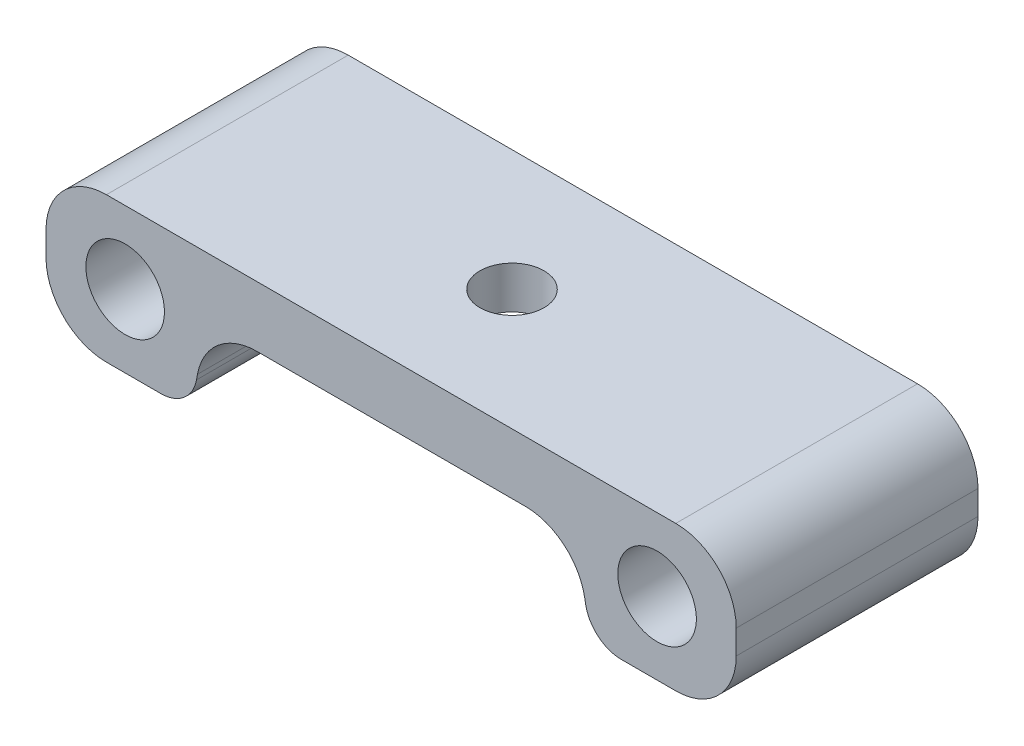
ISO-10303-21;
HEADER;
FILE_DESCRIPTION(('STEP AP214'),'2;1');
FILE_NAME('part.step','',(''),(''),'','','');
FILE_SCHEMA(('AUTOMOTIVE_DESIGN { 1 0 10303 214 1 1 1 1 }'));
ENDSEC;
DATA;
#1=APPLICATION_CONTEXT('core data for automotive mechanical design processes');
#2=APPLICATION_PROTOCOL_DEFINITION('international standard','automotive_design',2000,#1);
#3=PRODUCT_CONTEXT('',#1,'mechanical');
#4=PRODUCT('Part','Part','',(#3));
#5=PRODUCT_RELATED_PRODUCT_CATEGORY('part','',(#4));
#6=PRODUCT_DEFINITION_FORMATION('','',#4);
#7=PRODUCT_DEFINITION_CONTEXT('part definition',#1,'design');
#8=PRODUCT_DEFINITION('design','',#6,#7);
#9=PRODUCT_DEFINITION_SHAPE('','',#8);
#10=(LENGTH_UNIT() NAMED_UNIT(*) SI_UNIT(.MILLI.,.METRE.));
#11=(NAMED_UNIT(*) PLANE_ANGLE_UNIT() SI_UNIT($,.RADIAN.));
#12=(NAMED_UNIT(*) SI_UNIT($,.STERADIAN.) SOLID_ANGLE_UNIT());
#13=UNCERTAINTY_MEASURE_WITH_UNIT(LENGTH_MEASURE(1.E-05),#10,'distance_accuracy_value','');
#14=(GEOMETRIC_REPRESENTATION_CONTEXT(3) GLOBAL_UNCERTAINTY_ASSIGNED_CONTEXT((#13)) GLOBAL_UNIT_ASSIGNED_CONTEXT((#10,
#11,#12)) REPRESENTATION_CONTEXT('',''));
#15=CARTESIAN_POINT('',(0.,0.,0.));
#16=DIRECTION('',(0.,0.,1.));
#17=DIRECTION('',(1.,0.,0.));
#18=AXIS2_PLACEMENT_3D('',#15,#16,#17);
#19=CARTESIAN_POINT('',(0.,0.,10.));
#20=DIRECTION('',(0.,0.,-1.));
#21=DIRECTION('',(-1.,0.,0.));
#22=AXIS2_PLACEMENT_3D('',#19,#20,#21);
#23=PLANE('',#22);
#24=DIRECTION('',(-0.180192038345711,0.983631449942923,0.));
#25=VECTOR('',#24,1.);
#26=CARTESIAN_POINT('',(15.2657353642998,0.,10.));
#27=LINE('',#26,#25);
#28=CARTESIAN_POINT('',(16.0975262403234,-4.54057611503715,10.));
#29=VERTEX_POINT('',#28);
#30=CARTESIAN_POINT('',(16.0166409380851,-4.09903980827144,10.));
#31=VERTEX_POINT('',#30);
#32=EDGE_CURVE('E182',#29,#31,#27,.T.);
#33=ORIENTED_EDGE('',*,*,#32,.F.);
#34=CARTESIAN_POINT('',(19.0484205901522,-4.00000000000002,10.));
#35=DIRECTION('',(0.,0.,-1.));
#36=DIRECTION('',(-1.,0.,0.));
#37=AXIS2_PLACEMENT_3D('',#34,#35,#36);
#38=CIRCLE('',#37,3.);
#39=CARTESIAN_POINT('',(19.0484205901522,-7.00000000000002,10.));
#40=VERTEX_POINT('',#39);
#41=EDGE_CURVE('E279',#29,#40,#38,.F.);
#42=ORIENTED_EDGE('',*,*,#41,.T.);
#43=DIRECTION('',(-1.,0.,0.));
#44=VECTOR('',#43,1.);
#45=CARTESIAN_POINT('',(16.5480695845946,-7.00000000000001,10.));
#46=LINE('',#45,#44);
#47=CARTESIAN_POINT('',(23.5480695845946,-7.00000000000002,10.));
#48=VERTEX_POINT('',#47);
#49=EDGE_CURVE('E337',#48,#40,#46,.T.);
#50=ORIENTED_EDGE('',*,*,#49,.F.);
#51=CARTESIAN_POINT('',(23.5480695845946,-2.00000000000002,10.));
#52=DIRECTION('',(0.,0.,-1.));
#53=DIRECTION('',(-1.,0.,0.));
#54=AXIS2_PLACEMENT_3D('',#51,#52,#53);
#55=CIRCLE('',#54,5.);
#56=CARTESIAN_POINT('',(28.5480695845946,-2.00000000000003,10.));
#57=VERTEX_POINT('',#56);
#58=EDGE_CURVE('E232',#48,#57,#55,.F.);
#59=ORIENTED_EDGE('',*,*,#58,.T.);
#60=DIRECTION('',(0.,-1.,0.));
#61=VECTOR('',#60,1.);
#62=CARTESIAN_POINT('',(28.5480695845946,-7.00000000000003,10.));
#63=LINE('',#62,#61);
#64=CARTESIAN_POINT('',(28.5480695845946,0.,10.));
#65=VERTEX_POINT('',#64);
#66=EDGE_CURVE('E324',#65,#57,#63,.T.);
#67=ORIENTED_EDGE('',*,*,#66,.F.);
#68=CARTESIAN_POINT('',(23.5480695845946,0.,10.));
#69=DIRECTION('',(0.,0.,-1.));
#70=DIRECTION('',(-1.,0.,0.));
#71=AXIS2_PLACEMENT_3D('',#68,#69,#70);
#72=CIRCLE('',#71,5.);
#73=CARTESIAN_POINT('',(23.5480695845946,5.,10.));
#74=VERTEX_POINT('',#73);
#75=EDGE_CURVE('E229',#65,#74,#72,.F.);
#76=ORIENTED_EDGE('',*,*,#75,.T.);
#77=DIRECTION('',(-1.,0.,0.));
#78=VECTOR('',#77,1.);
#79=CARTESIAN_POINT('',(-28.5480695845946,5.,10.));
#80=LINE('',#79,#78);
#81=CARTESIAN_POINT('',(-23.5480695845946,5.,10.));
#82=VERTEX_POINT('',#81);
#83=EDGE_CURVE('E296',#74,#82,#80,.T.);
#84=ORIENTED_EDGE('',*,*,#83,.T.);
#85=CARTESIAN_POINT('',(-23.5480695845946,0.,10.));
#86=DIRECTION('',(0.,0.,-1.));
#87=DIRECTION('',(-1.,0.,0.));
#88=AXIS2_PLACEMENT_3D('',#85,#86,#87);
#89=CIRCLE('',#88,5.);
#90=CARTESIAN_POINT('',(-28.5480695845946,0.,10.));
#91=VERTEX_POINT('',#90);
#92=EDGE_CURVE('E223',#82,#91,#89,.F.);
#93=ORIENTED_EDGE('',*,*,#92,.T.);
#94=DIRECTION('',(0.,-1.,0.));
#95=VECTOR('',#94,1.);
#96=CARTESIAN_POINT('',(-28.5480695845946,-7.,10.));
#97=LINE('',#96,#95);
#98=CARTESIAN_POINT('',(-28.5480695845946,-2.,10.));
#99=VERTEX_POINT('',#98);
#100=EDGE_CURVE('E313',#91,#99,#97,.T.);
#101=ORIENTED_EDGE('',*,*,#100,.T.);
#102=CARTESIAN_POINT('',(-23.5480695845946,-2.,10.));
#103=DIRECTION('',(0.,0.,-1.));
#104=DIRECTION('',(-1.,0.,0.));
#105=AXIS2_PLACEMENT_3D('',#102,#103,#104);
#106=CIRCLE('',#105,5.);
#107=CARTESIAN_POINT('',(-23.5480695845946,-7.,10.));
#108=VERTEX_POINT('',#107);
#109=EDGE_CURVE('E226',#99,#108,#106,.F.);
#110=ORIENTED_EDGE('',*,*,#109,.T.);
#111=DIRECTION('',(1.,0.,0.));
#112=VECTOR('',#111,1.);
#113=CARTESIAN_POINT('',(-16.5480695845946,-7.,10.));
#114=LINE('',#113,#112);
#115=CARTESIAN_POINT('',(-19.0484205901522,-7.,10.));
#116=VERTEX_POINT('',#115);
#117=EDGE_CURVE('E310',#108,#116,#114,.T.);
#118=ORIENTED_EDGE('',*,*,#117,.T.);
#119=CARTESIAN_POINT('',(-19.0484205901522,-4.,10.));
#120=DIRECTION('',(0.,0.,-1.));
#121=DIRECTION('',(-1.,0.,0.));
#122=AXIS2_PLACEMENT_3D('',#119,#120,#121);
#123=CIRCLE('',#122,3.);
#124=CARTESIAN_POINT('',(-16.0975262403234,-4.54057611503714,10.));
#125=VERTEX_POINT('',#124);
#126=EDGE_CURVE('E56',#116,#125,#123,.F.);
#127=ORIENTED_EDGE('',*,*,#126,.T.);
#128=DIRECTION('',(0.180192038345712,0.983631449942923,0.));
#129=VECTOR('',#128,1.);
#130=CARTESIAN_POINT('',(-15.2657353642998,0.,10.));
#131=LINE('',#130,#129);
#132=CARTESIAN_POINT('',(-16.0166409380851,-4.09903980827144,10.));
#133=VERTEX_POINT('',#132);
#134=EDGE_CURVE('E193',#125,#133,#131,.T.);
#135=ORIENTED_EDGE('',*,*,#134,.T.);
#136=CARTESIAN_POINT('',(-11.0984836883705,-5.,10.));
#137=DIRECTION('',(0.,0.,-1.));
#138=DIRECTION('',(-1.,0.,0.));
#139=AXIS2_PLACEMENT_3D('',#136,#137,#138);
#140=CIRCLE('',#139,5.);
#141=CARTESIAN_POINT('',(-11.0984836883705,0.,10.));
#142=VERTEX_POINT('',#141);
#143=EDGE_CURVE('E262',#133,#142,#140,.T.);
#144=ORIENTED_EDGE('',*,*,#143,.T.);
#145=DIRECTION('',(1.,0.,0.));
#146=VECTOR('',#145,1.);
#147=CARTESIAN_POINT('',(0.,0.,10.));
#148=LINE('',#147,#146);
#149=CARTESIAN_POINT('',(11.0984836883705,0.,10.));
#150=VERTEX_POINT('',#149);
#151=EDGE_CURVE('E186',#142,#150,#148,.T.);
#152=ORIENTED_EDGE('',*,*,#151,.T.);
#153=CARTESIAN_POINT('',(11.0984836883705,-5.,10.));
#154=DIRECTION('',(0.,0.,-1.));
#155=DIRECTION('',(-1.,0.,0.));
#156=AXIS2_PLACEMENT_3D('',#153,#154,#155);
#157=CIRCLE('',#156,5.);
#158=EDGE_CURVE('E177',#150,#31,#157,.T.);
#159=ORIENTED_EDGE('',*,*,#158,.T.);
#160=EDGE_LOOP('',(#33,#42,#50,#59,#67,#76,#84,#93,#101,#110,#118,#127,#135,#144,#152,#159));
#161=FACE_BOUND('',#160,.T.);
#162=CARTESIAN_POINT('',(-22.,-0.999999999999998,10.));
#163=DIRECTION('',(0.,0.,1.));
#164=DIRECTION('',(1.,0.,0.));
#165=AXIS2_PLACEMENT_3D('',#162,#163,#164);
#166=CIRCLE('',#165,3.25);
#167=CARTESIAN_POINT('',(-18.75,-0.999999999999998,10.));
#168=VERTEX_POINT('',#167);
#169=EDGE_CURVE('E306',#168,#168,#166,.T.);
#170=ORIENTED_EDGE('',*,*,#169,.F.);
#171=EDGE_LOOP('',(#170));
#172=FACE_BOUND('',#171,.T.);
#173=CARTESIAN_POINT('',(22.,-1.00000000000002,10.));
#174=DIRECTION('',(0.,0.,-1.));
#175=DIRECTION('',(-1.,0.,0.));
#176=AXIS2_PLACEMENT_3D('',#173,#174,#175);
#177=CIRCLE('',#176,3.25);
#178=CARTESIAN_POINT('',(18.75,-1.00000000000002,10.));
#179=VERTEX_POINT('',#178);
#180=EDGE_CURVE('E167',#179,#179,#177,.T.);
#181=ORIENTED_EDGE('',*,*,#180,.T.);
#182=EDGE_LOOP('',(#181));
#183=FACE_BOUND('',#182,.T.);
#184=ADVANCED_FACE('F39',(#161,#172,#183),#23,.F.);
#185=CARTESIAN_POINT('',(0.,0.,-10.));
#186=DIRECTION('',(0.,0.,-1.));
#187=DIRECTION('',(-1.,0.,0.));
#188=AXIS2_PLACEMENT_3D('',#185,#186,#187);
#189=PLANE('',#188);
#190=DIRECTION('',(-1.,0.,0.));
#191=VECTOR('',#190,1.);
#192=CARTESIAN_POINT('',(16.5480695845946,-7.00000000000001,-10.));
#193=LINE('',#192,#191);
#194=CARTESIAN_POINT('',(23.5480695845946,-7.00000000000002,-10.));
#195=VERTEX_POINT('',#194);
#196=CARTESIAN_POINT('',(19.0484205901522,-7.00000000000002,-10.));
#197=VERTEX_POINT('',#196);
#198=EDGE_CURVE('E166',#195,#197,#193,.T.);
#199=ORIENTED_EDGE('',*,*,#198,.T.);
#200=CARTESIAN_POINT('',(19.0484205901522,-4.00000000000002,-10.));
#201=DIRECTION('',(0.,0.,-1.));
#202=DIRECTION('',(-1.,0.,0.));
#203=AXIS2_PLACEMENT_3D('',#200,#201,#202);
#204=CIRCLE('',#203,3.);
#205=CARTESIAN_POINT('',(16.0975262403234,-4.54057611503715,-10.));
#206=VERTEX_POINT('',#205);
#207=EDGE_CURVE('E161',#197,#206,#204,.T.);
#208=ORIENTED_EDGE('',*,*,#207,.T.);
#209=DIRECTION('',(-0.180192038345711,0.983631449942923,0.));
#210=VECTOR('',#209,1.);
#211=CARTESIAN_POINT('',(15.2657353642998,0.,-10.));
#212=LINE('',#211,#210);
#213=CARTESIAN_POINT('',(16.0166409380851,-4.09903980827144,-10.));
#214=VERTEX_POINT('',#213);
#215=EDGE_CURVE('E153',#206,#214,#212,.T.);
#216=ORIENTED_EDGE('',*,*,#215,.T.);
#217=CARTESIAN_POINT('',(11.0984836883705,-5.,-10.));
#218=DIRECTION('',(0.,0.,-1.));
#219=DIRECTION('',(-1.,0.,0.));
#220=AXIS2_PLACEMENT_3D('',#217,#218,#219);
#221=CIRCLE('',#220,5.);
#222=CARTESIAN_POINT('',(11.0984836883705,0.,-10.));
#223=VERTEX_POINT('',#222);
#224=EDGE_CURVE('E159',#214,#223,#221,.F.);
#225=ORIENTED_EDGE('',*,*,#224,.T.);
#226=DIRECTION('',(1.,0.,0.));
#227=VECTOR('',#226,1.);
#228=CARTESIAN_POINT('',(0.,0.,-10.));
#229=LINE('',#228,#227);
#230=CARTESIAN_POINT('',(-11.0984836883705,0.,-10.));
#231=VERTEX_POINT('',#230);
#232=EDGE_CURVE('E196',#231,#223,#229,.T.);
#233=ORIENTED_EDGE('',*,*,#232,.F.);
#234=CARTESIAN_POINT('',(-11.0984836883705,-5.,-10.));
#235=DIRECTION('',(0.,0.,-1.));
#236=DIRECTION('',(-1.,0.,0.));
#237=AXIS2_PLACEMENT_3D('',#234,#235,#236);
#238=CIRCLE('',#237,5.);
#239=CARTESIAN_POINT('',(-16.0166409380851,-4.09903980827144,-10.));
#240=VERTEX_POINT('',#239);
#241=EDGE_CURVE('E258',#231,#240,#238,.F.);
#242=ORIENTED_EDGE('',*,*,#241,.T.);
#243=DIRECTION('',(0.180192038345712,0.983631449942923,0.));
#244=VECTOR('',#243,1.);
#245=CARTESIAN_POINT('',(-15.2657353642998,0.,-10.));
#246=LINE('',#245,#244);
#247=CARTESIAN_POINT('',(-16.0975262403234,-4.54057611503714,-10.));
#248=VERTEX_POINT('',#247);
#249=EDGE_CURVE('E288',#248,#240,#246,.T.);
#250=ORIENTED_EDGE('',*,*,#249,.F.);
#251=CARTESIAN_POINT('',(-19.0484205901522,-4.,-10.));
#252=DIRECTION('',(0.,0.,-1.));
#253=DIRECTION('',(-1.,0.,0.));
#254=AXIS2_PLACEMENT_3D('',#251,#252,#253);
#255=CIRCLE('',#254,3.);
#256=CARTESIAN_POINT('',(-19.0484205901522,-7.,-10.));
#257=VERTEX_POINT('',#256);
#258=EDGE_CURVE('E269',#248,#257,#255,.T.);
#259=ORIENTED_EDGE('',*,*,#258,.T.);
#260=DIRECTION('',(1.,0.,0.));
#261=VECTOR('',#260,1.);
#262=CARTESIAN_POINT('',(-16.5480695845946,-7.,-10.));
#263=LINE('',#262,#261);
#264=CARTESIAN_POINT('',(-23.5480695845946,-7.,-10.));
#265=VERTEX_POINT('',#264);
#266=EDGE_CURVE('E293',#265,#257,#263,.T.);
#267=ORIENTED_EDGE('',*,*,#266,.F.);
#268=CARTESIAN_POINT('',(-23.5480695845946,-2.,-10.));
#269=DIRECTION('',(0.,0.,-1.));
#270=DIRECTION('',(-1.,0.,0.));
#271=AXIS2_PLACEMENT_3D('',#268,#269,#270);
#272=CIRCLE('',#271,5.);
#273=CARTESIAN_POINT('',(-28.5480695845946,-2.,-10.));
#274=VERTEX_POINT('',#273);
#275=EDGE_CURVE('E211',#265,#274,#272,.T.);
#276=ORIENTED_EDGE('',*,*,#275,.T.);
#277=DIRECTION('',(0.,-1.,0.));
#278=VECTOR('',#277,1.);
#279=CARTESIAN_POINT('',(-28.5480695845946,-7.,-10.));
#280=LINE('',#279,#278);
#281=CARTESIAN_POINT('',(-28.5480695845946,0.,-10.));
#282=VERTEX_POINT('',#281);
#283=EDGE_CURVE('E297',#282,#274,#280,.T.);
#284=ORIENTED_EDGE('',*,*,#283,.F.);
#285=CARTESIAN_POINT('',(-23.5480695845946,0.,-10.));
#286=DIRECTION('',(0.,0.,-1.));
#287=DIRECTION('',(-1.,0.,0.));
#288=AXIS2_PLACEMENT_3D('',#285,#286,#287);
#289=CIRCLE('',#288,5.);
#290=CARTESIAN_POINT('',(-23.5480695845946,5.,-10.));
#291=VERTEX_POINT('',#290);
#292=EDGE_CURVE('E208',#282,#291,#289,.T.);
#293=ORIENTED_EDGE('',*,*,#292,.T.);
#294=DIRECTION('',(-1.,0.,0.));
#295=VECTOR('',#294,1.);
#296=CARTESIAN_POINT('',(-28.5480695845946,5.,-10.));
#297=LINE('',#296,#295);
#298=CARTESIAN_POINT('',(23.5480695845946,5.,-10.));
#299=VERTEX_POINT('',#298);
#300=EDGE_CURVE('E303',#299,#291,#297,.T.);
#301=ORIENTED_EDGE('',*,*,#300,.F.);
#302=CARTESIAN_POINT('',(23.5480695845946,0.,-10.));
#303=DIRECTION('',(0.,0.,-1.));
#304=DIRECTION('',(-1.,0.,0.));
#305=AXIS2_PLACEMENT_3D('',#302,#303,#304);
#306=CIRCLE('',#305,5.);
#307=CARTESIAN_POINT('',(28.5480695845946,0.,-10.));
#308=VERTEX_POINT('',#307);
#309=EDGE_CURVE('E214',#299,#308,#306,.T.);
#310=ORIENTED_EDGE('',*,*,#309,.T.);
#311=DIRECTION('',(0.,-1.,0.));
#312=VECTOR('',#311,1.);
#313=CARTESIAN_POINT('',(28.5480695845946,-7.00000000000003,-10.));
#314=LINE('',#313,#312);
#315=CARTESIAN_POINT('',(28.5480695845946,-2.00000000000003,-10.));
#316=VERTEX_POINT('',#315);
#317=EDGE_CURVE('E328',#308,#316,#314,.T.);
#318=ORIENTED_EDGE('',*,*,#317,.T.);
#319=CARTESIAN_POINT('',(23.5480695845946,-2.00000000000002,-10.));
#320=DIRECTION('',(0.,0.,-1.));
#321=DIRECTION('',(-1.,0.,0.));
#322=AXIS2_PLACEMENT_3D('',#319,#320,#321);
#323=CIRCLE('',#322,5.);
#324=EDGE_CURVE('E217',#316,#195,#323,.T.);
#325=ORIENTED_EDGE('',*,*,#324,.T.);
#326=EDGE_LOOP('',(#199,#208,#216,#225,#233,#242,#250,#259,#267,#276,#284,#293,#301,#310,#318,#325));
#327=FACE_BOUND('',#326,.T.);
#328=CARTESIAN_POINT('',(-22.,-0.999999999999998,-10.));
#329=DIRECTION('',(0.,0.,1.));
#330=DIRECTION('',(1.,0.,0.));
#331=AXIS2_PLACEMENT_3D('',#328,#329,#330);
#332=CIRCLE('',#331,3.25);
#333=CARTESIAN_POINT('',(-18.75,-0.999999999999998,-10.));
#334=VERTEX_POINT('',#333);
#335=EDGE_CURVE('E320',#334,#334,#332,.T.);
#336=ORIENTED_EDGE('',*,*,#335,.T.);
#337=EDGE_LOOP('',(#336));
#338=FACE_BOUND('',#337,.T.);
#339=CARTESIAN_POINT('',(22.,-1.00000000000002,-10.));
#340=DIRECTION('',(0.,0.,-1.));
#341=DIRECTION('',(-1.,0.,0.));
#342=AXIS2_PLACEMENT_3D('',#339,#340,#341);
#343=CIRCLE('',#342,3.25);
#344=CARTESIAN_POINT('',(18.75,-1.00000000000002,-10.));
#345=VERTEX_POINT('',#344);
#346=EDGE_CURVE('E343',#345,#345,#343,.T.);
#347=ORIENTED_EDGE('',*,*,#346,.F.);
#348=EDGE_LOOP('',(#347));
#349=FACE_BOUND('',#348,.T.);
#350=ADVANCED_FACE('F156',(#327,#338,#349),#189,.T.);
#351=CARTESIAN_POINT('',(-28.5480695845946,5.,10.));
#352=DIRECTION('',(0.,-1.,0.));
#353=DIRECTION('',(0.,0.,-1.));
#354=AXIS2_PLACEMENT_3D('',#351,#352,#353);
#355=PLANE('',#354);
#356=CARTESIAN_POINT('',(0.,5.,0.));
#357=DIRECTION('',(0.,1.,0.));
#358=DIRECTION('',(0.,0.,1.));
#359=AXIS2_PLACEMENT_3D('',#356,#357,#358);
#360=CIRCLE('',#359,2.65);
#361=CARTESIAN_POINT('',(0.,5.,2.65));
#362=VERTEX_POINT('',#361);
#363=EDGE_CURVE('E358',#362,#362,#360,.T.);
#364=ORIENTED_EDGE('',*,*,#363,.F.);
#365=EDGE_LOOP('',(#364));
#366=FACE_BOUND('',#365,.T.);
#367=ORIENTED_EDGE('',*,*,#83,.F.);
#368=DIRECTION('',(0.,0.,-1.));
#369=VECTOR('',#368,1.);
#370=CARTESIAN_POINT('',(23.5480695845946,5.,-10.));
#371=LINE('',#370,#369);
#372=EDGE_CURVE('E238',#74,#299,#371,.T.);
#373=ORIENTED_EDGE('',*,*,#372,.T.);
#374=ORIENTED_EDGE('',*,*,#300,.T.);
#375=DIRECTION('',(0.,0.,-1.));
#376=VECTOR('',#375,1.);
#377=CARTESIAN_POINT('',(-23.5480695845946,5.,10.));
#378=LINE('',#377,#376);
#379=EDGE_CURVE('E235',#291,#82,#378,.F.);
#380=ORIENTED_EDGE('',*,*,#379,.T.);
#381=EDGE_LOOP('',(#367,#373,#374,#380));
#382=FACE_BOUND('',#381,.T.);
#383=ADVANCED_FACE('F417',(#366,#382),#355,.F.);
#384=CARTESIAN_POINT('',(-28.5480695845946,-7.,10.));
#385=DIRECTION('',(1.,0.,0.));
#386=DIRECTION('',(0.,1.,0.));
#387=AXIS2_PLACEMENT_3D('',#384,#385,#386);
#388=PLANE('',#387);
#389=ORIENTED_EDGE('',*,*,#283,.T.);
#390=DIRECTION('',(0.,0.,-1.));
#391=VECTOR('',#390,1.);
#392=CARTESIAN_POINT('',(-28.5480695845946,-2.,10.));
#393=LINE('',#392,#391);
#394=EDGE_CURVE('E178',#274,#99,#393,.F.);
#395=ORIENTED_EDGE('',*,*,#394,.T.);
#396=ORIENTED_EDGE('',*,*,#100,.F.);
#397=DIRECTION('',(0.,0.,-1.));
#398=VECTOR('',#397,1.);
#399=CARTESIAN_POINT('',(-28.5480695845946,0.,10.));
#400=LINE('',#399,#398);
#401=EDGE_CURVE('E250',#91,#282,#400,.T.);
#402=ORIENTED_EDGE('',*,*,#401,.T.);
#403=EDGE_LOOP('',(#389,#395,#396,#402));
#404=FACE_BOUND('',#403,.T.);
#405=ADVANCED_FACE('F426',(#404),#388,.F.);
#406=CARTESIAN_POINT('',(-16.5480695845946,-7.,10.));
#407=DIRECTION('',(0.,1.,0.));
#408=DIRECTION('',(-1.,0.,0.));
#409=AXIS2_PLACEMENT_3D('',#406,#407,#408);
#410=PLANE('',#409);
#411=ORIENTED_EDGE('',*,*,#266,.T.);
#412=DIRECTION('',(0.,0.,-1.));
#413=VECTOR('',#412,1.);
#414=CARTESIAN_POINT('',(-19.0484205901522,-7.,10.));
#415=LINE('',#414,#413);
#416=EDGE_CURVE('E11',#257,#116,#415,.F.);
#417=ORIENTED_EDGE('',*,*,#416,.T.);
#418=ORIENTED_EDGE('',*,*,#117,.F.);
#419=DIRECTION('',(0.,0.,-1.));
#420=VECTOR('',#419,1.);
#421=CARTESIAN_POINT('',(-23.5480695845946,-7.,10.));
#422=LINE('',#421,#420);
#423=EDGE_CURVE('E246',#108,#265,#422,.T.);
#424=ORIENTED_EDGE('',*,*,#423,.T.);
#425=EDGE_LOOP('',(#411,#417,#418,#424));
#426=FACE_BOUND('',#425,.T.);
#427=ADVANCED_FACE('F432',(#426),#410,.F.);
#428=CARTESIAN_POINT('',(-15.2657353642998,0.,10.));
#429=DIRECTION('',(-0.983631449942923,0.180192038345712,0.));
#430=DIRECTION('',(-0.180192038345712,-0.983631449942923,0.));
#431=AXIS2_PLACEMENT_3D('',#428,#429,#430);
#432=PLANE('',#431);
#433=ORIENTED_EDGE('',*,*,#134,.F.);
#434=DIRECTION('',(0.,0.,-1.));
#435=VECTOR('',#434,1.);
#436=CARTESIAN_POINT('',(-16.0975262403234,-4.54057611503713,10.));
#437=LINE('',#436,#435);
#438=EDGE_CURVE('E49',#125,#248,#437,.T.);
#439=ORIENTED_EDGE('',*,*,#438,.T.);
#440=ORIENTED_EDGE('',*,*,#249,.T.);
#441=DIRECTION('',(0.,0.,-1.));
#442=VECTOR('',#441,1.);
#443=CARTESIAN_POINT('',(-16.0166409380851,-4.09903980827144,10.));
#444=LINE('',#443,#442);
#445=EDGE_CURVE('E242',#240,#133,#444,.F.);
#446=ORIENTED_EDGE('',*,*,#445,.T.);
#447=EDGE_LOOP('',(#433,#439,#440,#446));
#448=FACE_BOUND('',#447,.T.);
#449=ADVANCED_FACE('F287',(#448),#432,.F.);
#450=CARTESIAN_POINT('',(0.,0.,10.));
#451=DIRECTION('',(0.,1.,0.));
#452=DIRECTION('',(-1.,0.,0.));
#453=AXIS2_PLACEMENT_3D('',#450,#451,#452);
#454=PLANE('',#453);
#455=CARTESIAN_POINT('',(0.,0.,0.));
#456=DIRECTION('',(0.,-1.,0.));
#457=DIRECTION('',(1.,0.,0.));
#458=AXIS2_PLACEMENT_3D('',#455,#456,#457);
#459=CIRCLE('',#458,6.);
#460=CARTESIAN_POINT('',(6.,0.,0.));
#461=VERTEX_POINT('',#460);
#462=EDGE_CURVE('E351',#461,#461,#459,.T.);
#463=ORIENTED_EDGE('',*,*,#462,.F.);
#464=EDGE_LOOP('',(#463));
#465=FACE_BOUND('',#464,.T.);
#466=ORIENTED_EDGE('',*,*,#232,.T.);
#467=DIRECTION('',(0.,0.,-1.));
#468=VECTOR('',#467,1.);
#469=CARTESIAN_POINT('',(11.0984836883705,0.,10.));
#470=LINE('',#469,#468);
#471=EDGE_CURVE('E175',#223,#150,#470,.F.);
#472=ORIENTED_EDGE('',*,*,#471,.T.);
#473=ORIENTED_EDGE('',*,*,#151,.F.);
#474=DIRECTION('',(0.,0.,-1.));
#475=VECTOR('',#474,1.);
#476=CARTESIAN_POINT('',(-11.0984836883705,0.,-10.));
#477=LINE('',#476,#475);
#478=EDGE_CURVE('E185',#142,#231,#477,.T.);
#479=ORIENTED_EDGE('',*,*,#478,.T.);
#480=EDGE_LOOP('',(#466,#472,#473,#479));
#481=FACE_BOUND('',#480,.T.);
#482=ADVANCED_FACE('F381',(#465,#481),#454,.F.);
#483=CARTESIAN_POINT('',(-22.,-0.999999999999998,10.));
#484=DIRECTION('',(0.,0.,-1.));
#485=DIRECTION('',(-1.,0.,0.));
#486=AXIS2_PLACEMENT_3D('',#483,#484,#485);
#487=CYLINDRICAL_SURFACE('',#486,3.25);
#488=ORIENTED_EDGE('',*,*,#169,.T.);
#489=EDGE_LOOP('',(#488));
#490=FACE_BOUND('',#489,.T.);
#491=ORIENTED_EDGE('',*,*,#335,.F.);
#492=EDGE_LOOP('',(#491));
#493=FACE_BOUND('',#492,.T.);
#494=ADVANCED_FACE('F384',(#490,#493),#487,.F.);
#495=CARTESIAN_POINT('',(15.2657353642998,0.,10.));
#496=DIRECTION('',(-0.983631449942923,-0.180192038345711,0.));
#497=DIRECTION('',(0.180192038345711,-0.983631449942924,0.));
#498=AXIS2_PLACEMENT_3D('',#495,#496,#497);
#499=PLANE('',#498);
#500=ORIENTED_EDGE('',*,*,#215,.F.);
#501=DIRECTION('',(0.,0.,-1.));
#502=VECTOR('',#501,1.);
#503=CARTESIAN_POINT('',(16.0975262403234,-4.54057611503715,10.));
#504=LINE('',#503,#502);
#505=EDGE_CURVE('E274',#206,#29,#504,.F.);
#506=ORIENTED_EDGE('',*,*,#505,.T.);
#507=ORIENTED_EDGE('',*,*,#32,.T.);
#508=DIRECTION('',(0.,0.,-1.));
#509=VECTOR('',#508,1.);
#510=CARTESIAN_POINT('',(16.0166409380851,-4.09903980827144,10.));
#511=LINE('',#510,#509);
#512=EDGE_CURVE('E174',#31,#214,#511,.T.);
#513=ORIENTED_EDGE('',*,*,#512,.T.);
#514=EDGE_LOOP('',(#500,#506,#507,#513));
#515=FACE_BOUND('',#514,.T.);
#516=ADVANCED_FACE('F180',(#515),#499,.T.);
#517=CARTESIAN_POINT('',(16.5480695845946,-7.00000000000001,10.));
#518=DIRECTION('',(0.,-1.,0.));
#519=DIRECTION('',(1.,0.,0.));
#520=AXIS2_PLACEMENT_3D('',#517,#518,#519);
#521=PLANE('',#520);
#522=ORIENTED_EDGE('',*,*,#49,.T.);
#523=DIRECTION('',(0.,0.,-1.));
#524=VECTOR('',#523,1.);
#525=CARTESIAN_POINT('',(19.0484205901522,-7.00000000000002,10.));
#526=LINE('',#525,#524);
#527=EDGE_CURVE('E265',#40,#197,#526,.T.);
#528=ORIENTED_EDGE('',*,*,#527,.T.);
#529=ORIENTED_EDGE('',*,*,#198,.F.);
#530=DIRECTION('',(0.,0.,-1.));
#531=VECTOR('',#530,1.);
#532=CARTESIAN_POINT('',(23.5480695845946,-7.00000000000002,10.));
#533=LINE('',#532,#531);
#534=EDGE_CURVE('E220',#195,#48,#533,.F.);
#535=ORIENTED_EDGE('',*,*,#534,.T.);
#536=EDGE_LOOP('',(#522,#528,#529,#535));
#537=FACE_BOUND('',#536,.T.);
#538=ADVANCED_FACE('F399',(#537),#521,.T.);
#539=CARTESIAN_POINT('',(28.5480695845946,-7.00000000000003,10.));
#540=DIRECTION('',(1.,0.,0.));
#541=DIRECTION('',(0.,1.,0.));
#542=AXIS2_PLACEMENT_3D('',#539,#540,#541);
#543=PLANE('',#542);
#544=ORIENTED_EDGE('',*,*,#66,.T.);
#545=DIRECTION('',(0.,0.,-1.));
#546=VECTOR('',#545,1.);
#547=CARTESIAN_POINT('',(28.5480695845946,-2.00000000000003,10.));
#548=LINE('',#547,#546);
#549=EDGE_CURVE('E204',#57,#316,#548,.T.);
#550=ORIENTED_EDGE('',*,*,#549,.T.);
#551=ORIENTED_EDGE('',*,*,#317,.F.);
#552=DIRECTION('',(0.,0.,-1.));
#553=VECTOR('',#552,1.);
#554=CARTESIAN_POINT('',(28.5480695845946,0.,10.));
#555=LINE('',#554,#553);
#556=EDGE_CURVE('E201',#308,#65,#555,.F.);
#557=ORIENTED_EDGE('',*,*,#556,.T.);
#558=EDGE_LOOP('',(#544,#550,#551,#557));
#559=FACE_BOUND('',#558,.T.);
#560=ADVANCED_FACE('F407',(#559),#543,.T.);
#561=CARTESIAN_POINT('',(22.,-1.00000000000002,10.));
#562=DIRECTION('',(0.,0.,-1.));
#563=DIRECTION('',(-1.,0.,0.));
#564=AXIS2_PLACEMENT_3D('',#561,#562,#563);
#565=CYLINDRICAL_SURFACE('',#564,3.25);
#566=ORIENTED_EDGE('',*,*,#180,.F.);
#567=EDGE_LOOP('',(#566));
#568=FACE_BOUND('',#567,.T.);
#569=ORIENTED_EDGE('',*,*,#346,.T.);
#570=EDGE_LOOP('',(#569));
#571=FACE_BOUND('',#570,.T.);
#572=ADVANCED_FACE('F457',(#568,#571),#565,.F.);
#573=CARTESIAN_POINT('',(11.0984836883705,-5.,10.));
#574=DIRECTION('',(0.,0.,-1.));
#575=DIRECTION('',(-1.,0.,0.));
#576=AXIS2_PLACEMENT_3D('',#573,#574,#575);
#577=CYLINDRICAL_SURFACE('',#576,5.);
#578=ORIENTED_EDGE('',*,*,#158,.F.);
#579=ORIENTED_EDGE('',*,*,#471,.F.);
#580=ORIENTED_EDGE('',*,*,#224,.F.);
#581=ORIENTED_EDGE('',*,*,#512,.F.);
#582=EDGE_LOOP('',(#578,#579,#580,#581));
#583=FACE_BOUND('',#582,.T.);
#584=ADVANCED_FACE('F173',(#583),#577,.F.);
#585=CARTESIAN_POINT('',(23.5480695845946,-2.00000000000002,10.));
#586=DIRECTION('',(0.,0.,-1.));
#587=DIRECTION('',(-1.,0.,0.));
#588=AXIS2_PLACEMENT_3D('',#585,#586,#587);
#589=CYLINDRICAL_SURFACE('',#588,5.);
#590=ORIENTED_EDGE('',*,*,#58,.F.);
#591=ORIENTED_EDGE('',*,*,#534,.F.);
#592=ORIENTED_EDGE('',*,*,#324,.F.);
#593=ORIENTED_EDGE('',*,*,#549,.F.);
#594=EDGE_LOOP('',(#590,#591,#592,#593));
#595=FACE_BOUND('',#594,.T.);
#596=ADVANCED_FACE('F405',(#595),#589,.T.);
#597=CARTESIAN_POINT('',(23.5480695845946,0.,10.));
#598=DIRECTION('',(0.,0.,1.));
#599=DIRECTION('',(1.,0.,0.));
#600=AXIS2_PLACEMENT_3D('',#597,#598,#599);
#601=CYLINDRICAL_SURFACE('',#600,5.);
#602=ORIENTED_EDGE('',*,*,#75,.F.);
#603=ORIENTED_EDGE('',*,*,#556,.F.);
#604=ORIENTED_EDGE('',*,*,#309,.F.);
#605=ORIENTED_EDGE('',*,*,#372,.F.);
#606=EDGE_LOOP('',(#602,#603,#604,#605));
#607=FACE_BOUND('',#606,.T.);
#608=ADVANCED_FACE('F414',(#607),#601,.T.);
#609=CARTESIAN_POINT('',(-11.0984836883705,-5.,10.));
#610=DIRECTION('',(0.,0.,1.));
#611=DIRECTION('',(1.,0.,0.));
#612=AXIS2_PLACEMENT_3D('',#609,#610,#611);
#613=CYLINDRICAL_SURFACE('',#612,5.);
#614=ORIENTED_EDGE('',*,*,#143,.F.);
#615=ORIENTED_EDGE('',*,*,#445,.F.);
#616=ORIENTED_EDGE('',*,*,#241,.F.);
#617=ORIENTED_EDGE('',*,*,#478,.F.);
#618=EDGE_LOOP('',(#614,#615,#616,#617));
#619=FACE_BOUND('',#618,.T.);
#620=ADVANCED_FACE('F390',(#619),#613,.F.);
#621=CARTESIAN_POINT('',(-23.5480695845946,-2.,10.));
#622=DIRECTION('',(0.,0.,-1.));
#623=DIRECTION('',(-1.,0.,0.));
#624=AXIS2_PLACEMENT_3D('',#621,#622,#623);
#625=CYLINDRICAL_SURFACE('',#624,5.);
#626=ORIENTED_EDGE('',*,*,#109,.F.);
#627=ORIENTED_EDGE('',*,*,#394,.F.);
#628=ORIENTED_EDGE('',*,*,#275,.F.);
#629=ORIENTED_EDGE('',*,*,#423,.F.);
#630=EDGE_LOOP('',(#626,#627,#628,#629));
#631=FACE_BOUND('',#630,.T.);
#632=ADVANCED_FACE('F431',(#631),#625,.T.);
#633=CARTESIAN_POINT('',(-23.5480695845946,0.,10.));
#634=DIRECTION('',(0.,0.,-1.));
#635=DIRECTION('',(-1.,0.,0.));
#636=AXIS2_PLACEMENT_3D('',#633,#634,#635);
#637=CYLINDRICAL_SURFACE('',#636,5.);
#638=ORIENTED_EDGE('',*,*,#92,.F.);
#639=ORIENTED_EDGE('',*,*,#379,.F.);
#640=ORIENTED_EDGE('',*,*,#292,.F.);
#641=ORIENTED_EDGE('',*,*,#401,.F.);
#642=EDGE_LOOP('',(#638,#639,#640,#641));
#643=FACE_BOUND('',#642,.T.);
#644=ADVANCED_FACE('F423',(#643),#637,.T.);
#645=CARTESIAN_POINT('',(19.0484205901522,-4.00000000000002,10.));
#646=DIRECTION('',(0.,0.,-1.));
#647=DIRECTION('',(-1.,0.,0.));
#648=AXIS2_PLACEMENT_3D('',#645,#646,#647);
#649=CYLINDRICAL_SURFACE('',#648,3.);
#650=ORIENTED_EDGE('',*,*,#41,.F.);
#651=ORIENTED_EDGE('',*,*,#505,.F.);
#652=ORIENTED_EDGE('',*,*,#207,.F.);
#653=ORIENTED_EDGE('',*,*,#527,.F.);
#654=EDGE_LOOP('',(#650,#651,#652,#653));
#655=FACE_BOUND('',#654,.T.);
#656=ADVANCED_FACE('F396',(#655),#649,.T.);
#657=CARTESIAN_POINT('',(-19.0484205901522,-4.,10.));
#658=DIRECTION('',(0.,0.,-1.));
#659=DIRECTION('',(-1.,0.,0.));
#660=AXIS2_PLACEMENT_3D('',#657,#658,#659);
#661=CYLINDRICAL_SURFACE('',#660,3.);
#662=ORIENTED_EDGE('',*,*,#126,.F.);
#663=ORIENTED_EDGE('',*,*,#416,.F.);
#664=ORIENTED_EDGE('',*,*,#258,.F.);
#665=ORIENTED_EDGE('',*,*,#438,.F.);
#666=EDGE_LOOP('',(#662,#663,#664,#665));
#667=FACE_BOUND('',#666,.T.);
#668=ADVANCED_FACE('F41',(#667),#661,.T.);
#669=CARTESIAN_POINT('',(0.,1.5,0.));
#670=DIRECTION('',(0.,-1.,0.));
#671=DIRECTION('',(1.,0.,0.));
#672=AXIS2_PLACEMENT_3D('',#669,#670,#671);
#673=CYLINDRICAL_SURFACE('',#672,6.);
#674=CARTESIAN_POINT('',(0.,1.5,0.));
#675=DIRECTION('',(0.,-1.,0.));
#676=DIRECTION('',(1.,0.,0.));
#677=AXIS2_PLACEMENT_3D('',#674,#675,#676);
#678=CIRCLE('',#677,6.);
#679=CARTESIAN_POINT('',(6.,1.5,0.));
#680=VERTEX_POINT('',#679);
#681=EDGE_CURVE('E347',#680,#680,#678,.T.);
#682=ORIENTED_EDGE('',*,*,#681,.F.);
#683=EDGE_LOOP('',(#682));
#684=FACE_BOUND('',#683,.T.);
#685=ORIENTED_EDGE('',*,*,#462,.T.);
#686=EDGE_LOOP('',(#685));
#687=FACE_BOUND('',#686,.T.);
#688=ADVANCED_FACE('F372',(#684,#687),#673,.F.);
#689=CARTESIAN_POINT('',(0.,1.5,0.));
#690=DIRECTION('',(0.,-1.,0.));
#691=DIRECTION('',(1.,0.,0.));
#692=AXIS2_PLACEMENT_3D('',#689,#690,#691);
#693=PLANE('',#692);
#694=CARTESIAN_POINT('',(0.,1.5,0.));
#695=DIRECTION('',(0.,-1.,0.));
#696=DIRECTION('',(1.,0.,0.));
#697=AXIS2_PLACEMENT_3D('',#694,#695,#696);
#698=CIRCLE('',#697,2.65);
#699=CARTESIAN_POINT('',(2.65,1.5,0.));
#700=VERTEX_POINT('',#699);
#701=EDGE_CURVE('E43',#700,#700,#698,.T.);
#702=ORIENTED_EDGE('',*,*,#701,.F.);
#703=EDGE_LOOP('',(#702));
#704=FACE_BOUND('',#703,.T.);
#705=ORIENTED_EDGE('',*,*,#681,.T.);
#706=EDGE_LOOP('',(#705));
#707=FACE_BOUND('',#706,.T.);
#708=ADVANCED_FACE('F369',(#704,#707),#693,.T.);
#709=CARTESIAN_POINT('',(0.,-7.00000000000002,0.));
#710=DIRECTION('',(0.,1.,0.));
#711=DIRECTION('',(0.,0.,1.));
#712=AXIS2_PLACEMENT_3D('',#709,#710,#711);
#713=CYLINDRICAL_SURFACE('',#712,2.65);
#714=ORIENTED_EDGE('',*,*,#701,.T.);
#715=EDGE_LOOP('',(#714));
#716=FACE_BOUND('',#715,.T.);
#717=ORIENTED_EDGE('',*,*,#363,.T.);
#718=EDGE_LOOP('',(#717));
#719=FACE_BOUND('',#718,.T.);
#720=ADVANCED_FACE('F367',(#716,#719),#713,.F.);
#721=CLOSED_SHELL('',(#184,#350,#383,#405,#427,#449,#482,#494,#516,#538,#560,#572,#584,#596,
#608,#620,#632,#644,#656,#668,#688,#708,#720));
#722=MANIFOLD_SOLID_BREP('B2',#721);
#723=ADVANCED_BREP_SHAPE_REPRESENTATION('',(#18,#722),#14);
#724=SHAPE_DEFINITION_REPRESENTATION(#9,#723);
ENDSEC;
END-ISO-10303-21;
